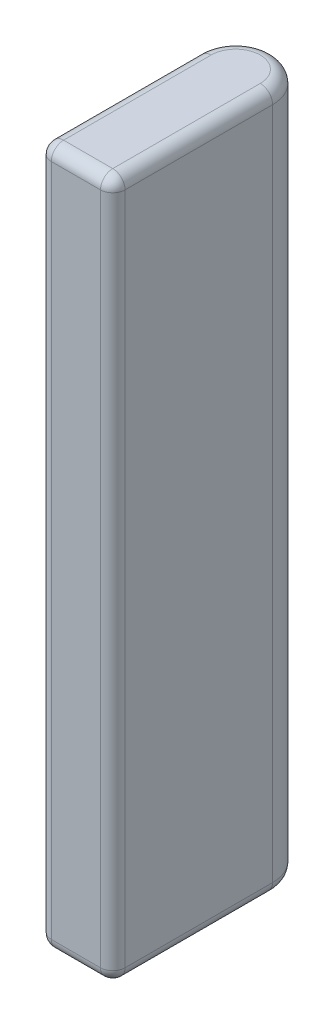
ISO-10303-21;
HEADER;
FILE_DESCRIPTION(('STEP AP214'),'2;1');
FILE_NAME('part.step','',(''),(''),'','','');
FILE_SCHEMA(('AUTOMOTIVE_DESIGN { 1 0 10303 214 1 1 1 1 }'));
ENDSEC;
DATA;
#1=APPLICATION_CONTEXT('core data for automotive mechanical design processes');
#2=APPLICATION_PROTOCOL_DEFINITION('international standard','automotive_design',2000,#1);
#3=PRODUCT_CONTEXT('',#1,'mechanical');
#4=PRODUCT('Part','Part','',(#3));
#5=PRODUCT_RELATED_PRODUCT_CATEGORY('part','',(#4));
#6=PRODUCT_DEFINITION_FORMATION('','',#4);
#7=PRODUCT_DEFINITION_CONTEXT('part definition',#1,'design');
#8=PRODUCT_DEFINITION('design','',#6,#7);
#9=PRODUCT_DEFINITION_SHAPE('','',#8);
#10=(LENGTH_UNIT() NAMED_UNIT(*) SI_UNIT(.MILLI.,.METRE.));
#11=(NAMED_UNIT(*) PLANE_ANGLE_UNIT() SI_UNIT($,.RADIAN.));
#12=(NAMED_UNIT(*) SI_UNIT($,.STERADIAN.) SOLID_ANGLE_UNIT());
#13=UNCERTAINTY_MEASURE_WITH_UNIT(LENGTH_MEASURE(1.E-05),#10,'distance_accuracy_value','');
#14=(GEOMETRIC_REPRESENTATION_CONTEXT(3) GLOBAL_UNCERTAINTY_ASSIGNED_CONTEXT((#13)) GLOBAL_UNIT_ASSIGNED_CONTEXT((#10,
#11,#12)) REPRESENTATION_CONTEXT('',''));
#15=CARTESIAN_POINT('',(0.,0.,0.));
#16=DIRECTION('',(0.,0.,1.));
#17=DIRECTION('',(1.,0.,0.));
#18=AXIS2_PLACEMENT_3D('',#15,#16,#17);
#19=CARTESIAN_POINT('',(0.,28.4,-3.25));
#20=DIRECTION('',(0.,-1.,0.));
#21=DIRECTION('',(0.,0.,-1.));
#22=AXIS2_PLACEMENT_3D('',#19,#20,#21);
#23=CYLINDRICAL_SURFACE('',#22,1.5);
#24=DIRECTION('',(0.,-1.,0.));
#25=VECTOR('',#24,1.);
#26=CARTESIAN_POINT('',(1.5,28.4,-3.25));
#27=LINE('',#26,#25);
#28=CARTESIAN_POINT('',(1.5,27.9,-3.25));
#29=VERTEX_POINT('',#28);
#30=CARTESIAN_POINT('',(1.5,0.5,-3.25));
#31=VERTEX_POINT('',#30);
#32=EDGE_CURVE('E159',#29,#31,#27,.T.);
#33=ORIENTED_EDGE('',*,*,#32,.T.);
#34=CARTESIAN_POINT('',(0.,0.5,-3.25));
#35=DIRECTION('',(0.,1.,0.));
#36=DIRECTION('',(0.,0.,1.));
#37=AXIS2_PLACEMENT_3D('',#34,#35,#36);
#38=CIRCLE('',#37,1.5);
#39=CARTESIAN_POINT('',(-1.5,0.5,-3.25));
#40=VERTEX_POINT('',#39);
#41=EDGE_CURVE('E188',#31,#40,#38,.T.);
#42=ORIENTED_EDGE('',*,*,#41,.T.);
#43=DIRECTION('',(0.,-1.,0.));
#44=VECTOR('',#43,1.);
#45=CARTESIAN_POINT('',(-1.5,28.4,-3.25));
#46=LINE('',#45,#44);
#47=CARTESIAN_POINT('',(-1.5,27.9,-3.25));
#48=VERTEX_POINT('',#47);
#49=EDGE_CURVE('E156',#48,#40,#46,.T.);
#50=ORIENTED_EDGE('',*,*,#49,.F.);
#51=CARTESIAN_POINT('',(0.,27.9,-3.25));
#52=DIRECTION('',(0.,1.,0.));
#53=DIRECTION('',(0.,0.,1.));
#54=AXIS2_PLACEMENT_3D('',#51,#52,#53);
#55=CIRCLE('',#54,1.5);
#56=EDGE_CURVE('E186',#48,#29,#55,.F.);
#57=ORIENTED_EDGE('',*,*,#56,.T.);
#58=EDGE_LOOP('',(#33,#42,#50,#57));
#59=FACE_BOUND('',#58,.T.);
#60=ADVANCED_FACE('F44',(#59),#23,.T.);
#61=CARTESIAN_POINT('',(-1.5,28.4,0.));
#62=DIRECTION('',(1.,0.,0.));
#63=DIRECTION('',(0.,0.,-1.));
#64=AXIS2_PLACEMENT_3D('',#61,#62,#63);
#65=PLANE('',#64);
#66=ORIENTED_EDGE('',*,*,#49,.T.);
#67=DIRECTION('',(0.,0.,1.));
#68=VECTOR('',#67,1.);
#69=CARTESIAN_POINT('',(-1.5,0.5,0.));
#70=LINE('',#69,#68);
#71=CARTESIAN_POINT('',(-1.5,0.5,2.75));
#72=VERTEX_POINT('',#71);
#73=EDGE_CURVE('E170',#40,#72,#70,.T.);
#74=ORIENTED_EDGE('',*,*,#73,.T.);
#75=DIRECTION('',(0.,-1.,0.));
#76=VECTOR('',#75,1.);
#77=CARTESIAN_POINT('',(-1.5,28.4,2.75));
#78=LINE('',#77,#76);
#79=CARTESIAN_POINT('',(-1.5,27.9,2.75));
#80=VERTEX_POINT('',#79);
#81=EDGE_CURVE('E167',#72,#80,#78,.F.);
#82=ORIENTED_EDGE('',*,*,#81,.T.);
#83=DIRECTION('',(0.,0.,1.));
#84=VECTOR('',#83,1.);
#85=CARTESIAN_POINT('',(-1.5,27.9,-3.25));
#86=LINE('',#85,#84);
#87=EDGE_CURVE('E165',#80,#48,#86,.F.);
#88=ORIENTED_EDGE('',*,*,#87,.T.);
#89=EDGE_LOOP('',(#66,#74,#82,#88));
#90=FACE_BOUND('',#89,.T.);
#91=ADVANCED_FACE('F248',(#90),#65,.F.);
#92=CARTESIAN_POINT('',(0.,28.4,3.25));
#93=DIRECTION('',(0.,0.,-1.));
#94=DIRECTION('',(-1.,0.,0.));
#95=AXIS2_PLACEMENT_3D('',#92,#93,#94);
#96=PLANE('',#95);
#97=DIRECTION('',(0.,-1.,0.));
#98=VECTOR('',#97,1.);
#99=CARTESIAN_POINT('',(-0.999999999999999,28.4,3.25));
#100=LINE('',#99,#98);
#101=CARTESIAN_POINT('',(-0.999999999999999,27.9,3.25));
#102=VERTEX_POINT('',#101);
#103=CARTESIAN_POINT('',(-0.999999999999999,0.5,3.25));
#104=VERTEX_POINT('',#103);
#105=EDGE_CURVE('E131',#102,#104,#100,.T.);
#106=ORIENTED_EDGE('',*,*,#105,.T.);
#107=DIRECTION('',(1.,0.,0.));
#108=VECTOR('',#107,1.);
#109=CARTESIAN_POINT('',(0.,0.5,3.25));
#110=LINE('',#109,#108);
#111=CARTESIAN_POINT('',(1.,0.5,3.25));
#112=VERTEX_POINT('',#111);
#113=EDGE_CURVE('E127',#104,#112,#110,.T.);
#114=ORIENTED_EDGE('',*,*,#113,.T.);
#115=DIRECTION('',(0.,-1.,0.));
#116=VECTOR('',#115,1.);
#117=CARTESIAN_POINT('',(1.,28.4,3.25));
#118=LINE('',#117,#116);
#119=CARTESIAN_POINT('',(1.,27.9,3.25));
#120=VERTEX_POINT('',#119);
#121=EDGE_CURVE('E119',#112,#120,#118,.F.);
#122=ORIENTED_EDGE('',*,*,#121,.T.);
#123=DIRECTION('',(1.,0.,0.));
#124=VECTOR('',#123,1.);
#125=CARTESIAN_POINT('',(-1.5,27.9,3.25));
#126=LINE('',#125,#124);
#127=EDGE_CURVE('E124',#120,#102,#126,.F.);
#128=ORIENTED_EDGE('',*,*,#127,.T.);
#129=EDGE_LOOP('',(#106,#114,#122,#128));
#130=FACE_BOUND('',#129,.T.);
#131=ADVANCED_FACE('F122',(#130),#96,.F.);
#132=CARTESIAN_POINT('',(1.5,28.4,0.));
#133=DIRECTION('',(1.,0.,0.));
#134=DIRECTION('',(0.,0.,-1.));
#135=AXIS2_PLACEMENT_3D('',#132,#133,#134);
#136=PLANE('',#135);
#137=DIRECTION('',(0.,-1.,0.));
#138=VECTOR('',#137,1.);
#139=CARTESIAN_POINT('',(1.5,0.,2.75));
#140=LINE('',#139,#138);
#141=CARTESIAN_POINT('',(1.5,27.9,2.75));
#142=VERTEX_POINT('',#141);
#143=CARTESIAN_POINT('',(1.5,0.5,2.75));
#144=VERTEX_POINT('',#143);
#145=EDGE_CURVE('E138',#142,#144,#140,.T.);
#146=ORIENTED_EDGE('',*,*,#145,.T.);
#147=DIRECTION('',(0.,0.,1.));
#148=VECTOR('',#147,1.);
#149=CARTESIAN_POINT('',(1.5,0.5,-3.25));
#150=LINE('',#149,#148);
#151=EDGE_CURVE('E175',#144,#31,#150,.F.);
#152=ORIENTED_EDGE('',*,*,#151,.T.);
#153=ORIENTED_EDGE('',*,*,#32,.F.);
#154=DIRECTION('',(0.,0.,1.));
#155=VECTOR('',#154,1.);
#156=CARTESIAN_POINT('',(1.5,27.9,0.));
#157=LINE('',#156,#155);
#158=EDGE_CURVE('E172',#29,#142,#157,.T.);
#159=ORIENTED_EDGE('',*,*,#158,.T.);
#160=EDGE_LOOP('',(#146,#152,#153,#159));
#161=FACE_BOUND('',#160,.T.);
#162=ADVANCED_FACE('F400',(#161),#136,.T.);
#163=CARTESIAN_POINT('',(0.,28.4,0.));
#164=DIRECTION('',(0.,1.,0.));
#165=DIRECTION('',(0.,0.,1.));
#166=AXIS2_PLACEMENT_3D('',#163,#164,#165);
#167=PLANE('',#166);
#168=DIRECTION('',(1.,0.,0.));
#169=VECTOR('',#168,1.);
#170=CARTESIAN_POINT('',(1.5,28.4,2.75));
#171=LINE('',#170,#169);
#172=CARTESIAN_POINT('',(-0.999999999999999,28.4,2.75));
#173=VERTEX_POINT('',#172);
#174=CARTESIAN_POINT('',(1.,28.4,2.75));
#175=VERTEX_POINT('',#174);
#176=EDGE_CURVE('E53',#173,#175,#171,.T.);
#177=ORIENTED_EDGE('',*,*,#176,.T.);
#178=DIRECTION('',(0.,0.,1.));
#179=VECTOR('',#178,1.);
#180=CARTESIAN_POINT('',(1.,28.4,0.));
#181=LINE('',#180,#179);
#182=CARTESIAN_POINT('',(1.,28.4,-3.25));
#183=VERTEX_POINT('',#182);
#184=EDGE_CURVE('E11',#175,#183,#181,.F.);
#185=ORIENTED_EDGE('',*,*,#184,.T.);
#186=CARTESIAN_POINT('',(0.,28.4,-3.25));
#187=DIRECTION('',(0.,1.,0.));
#188=DIRECTION('',(0.,0.,1.));
#189=AXIS2_PLACEMENT_3D('',#186,#187,#188);
#190=CIRCLE('',#189,1.);
#191=CARTESIAN_POINT('',(-1.,28.4,-3.25));
#192=VERTEX_POINT('',#191);
#193=EDGE_CURVE('E190',#183,#192,#190,.T.);
#194=ORIENTED_EDGE('',*,*,#193,.T.);
#195=DIRECTION('',(0.,0.,1.));
#196=VECTOR('',#195,1.);
#197=CARTESIAN_POINT('',(-0.999999999999999,28.4,3.25));
#198=LINE('',#197,#196);
#199=EDGE_CURVE('E64',#192,#173,#198,.T.);
#200=ORIENTED_EDGE('',*,*,#199,.T.);
#201=EDGE_LOOP('',(#177,#185,#194,#200));
#202=FACE_BOUND('',#201,.T.);
#203=ADVANCED_FACE('F390',(#202),#167,.T.);
#204=CARTESIAN_POINT('',(0.,0.,0.));
#205=DIRECTION('',(0.,1.,0.));
#206=DIRECTION('',(0.,0.,1.));
#207=AXIS2_PLACEMENT_3D('',#204,#205,#206);
#208=PLANE('',#207);
#209=DIRECTION('',(1.,0.,0.));
#210=VECTOR('',#209,1.);
#211=CARTESIAN_POINT('',(0.,0.,2.75));
#212=LINE('',#211,#210);
#213=CARTESIAN_POINT('',(1.,0.,2.75));
#214=VERTEX_POINT('',#213);
#215=CARTESIAN_POINT('',(-0.999999999999999,0.,2.75));
#216=VERTEX_POINT('',#215);
#217=EDGE_CURVE('E181',#214,#216,#212,.F.);
#218=ORIENTED_EDGE('',*,*,#217,.T.);
#219=DIRECTION('',(0.,0.,1.));
#220=VECTOR('',#219,1.);
#221=CARTESIAN_POINT('',(-1.,0.,0.));
#222=LINE('',#221,#220);
#223=CARTESIAN_POINT('',(-1.,0.,-3.25));
#224=VERTEX_POINT('',#223);
#225=EDGE_CURVE('E183',#216,#224,#222,.F.);
#226=ORIENTED_EDGE('',*,*,#225,.T.);
#227=CARTESIAN_POINT('',(0.,0.,-3.25));
#228=DIRECTION('',(0.,1.,0.));
#229=DIRECTION('',(0.,0.,1.));
#230=AXIS2_PLACEMENT_3D('',#227,#228,#229);
#231=CIRCLE('',#230,1.);
#232=CARTESIAN_POINT('',(1.,0.,-3.25));
#233=VERTEX_POINT('',#232);
#234=EDGE_CURVE('E177',#224,#233,#231,.F.);
#235=ORIENTED_EDGE('',*,*,#234,.T.);
#236=DIRECTION('',(0.,0.,1.));
#237=VECTOR('',#236,1.);
#238=CARTESIAN_POINT('',(1.,0.,3.25));
#239=LINE('',#238,#237);
#240=EDGE_CURVE('E179',#233,#214,#239,.T.);
#241=ORIENTED_EDGE('',*,*,#240,.T.);
#242=EDGE_LOOP('',(#218,#226,#235,#241));
#243=FACE_BOUND('',#242,.T.);
#244=ADVANCED_FACE('F381',(#243),#208,.F.);
#245=CARTESIAN_POINT('',(1.,27.9,0.));
#246=DIRECTION('',(0.,0.,1.));
#247=DIRECTION('',(1.,0.,0.));
#248=AXIS2_PLACEMENT_3D('',#245,#246,#247);
#249=CYLINDRICAL_SURFACE('',#248,0.5);
#250=CARTESIAN_POINT('',(1.,27.9,2.75));
#251=DIRECTION('',(0.,0.,1.));
#252=DIRECTION('',(1.,0.,0.));
#253=AXIS2_PLACEMENT_3D('',#250,#251,#252);
#254=CIRCLE('',#253,0.5);
#255=EDGE_CURVE('E142',#142,#175,#254,.T.);
#256=ORIENTED_EDGE('',*,*,#255,.F.);
#257=ORIENTED_EDGE('',*,*,#158,.F.);
#258=CARTESIAN_POINT('',(1.,27.9,-3.25));
#259=DIRECTION('',(0.,0.,-1.));
#260=DIRECTION('',(-1.,0.,0.));
#261=AXIS2_PLACEMENT_3D('',#258,#259,#260);
#262=CIRCLE('',#261,0.5);
#263=EDGE_CURVE('E48',#183,#29,#262,.T.);
#264=ORIENTED_EDGE('',*,*,#263,.F.);
#265=ORIENTED_EDGE('',*,*,#184,.F.);
#266=EDGE_LOOP('',(#256,#257,#264,#265));
#267=FACE_BOUND('',#266,.T.);
#268=ADVANCED_FACE('F46',(#267),#249,.T.);
#269=CARTESIAN_POINT('',(1.,28.4,2.75));
#270=DIRECTION('',(0.,1.,0.));
#271=DIRECTION('',(0.,0.,1.));
#272=AXIS2_PLACEMENT_3D('',#269,#270,#271);
#273=CYLINDRICAL_SURFACE('',#272,0.5);
#274=CARTESIAN_POINT('',(1.,0.5,2.75));
#275=DIRECTION('',(0.,-1.,0.));
#276=DIRECTION('',(0.,0.,-1.));
#277=AXIS2_PLACEMENT_3D('',#274,#275,#276);
#278=CIRCLE('',#277,0.5);
#279=EDGE_CURVE('E143',#144,#112,#278,.T.);
#280=ORIENTED_EDGE('',*,*,#279,.F.);
#281=ORIENTED_EDGE('',*,*,#145,.F.);
#282=CARTESIAN_POINT('',(1.,27.9,2.75));
#283=DIRECTION('',(0.,1.,0.));
#284=DIRECTION('',(0.,0.,1.));
#285=AXIS2_PLACEMENT_3D('',#282,#283,#284);
#286=CIRCLE('',#285,0.5);
#287=EDGE_CURVE('E135',#120,#142,#286,.T.);
#288=ORIENTED_EDGE('',*,*,#287,.F.);
#289=ORIENTED_EDGE('',*,*,#121,.F.);
#290=EDGE_LOOP('',(#280,#281,#288,#289));
#291=FACE_BOUND('',#290,.T.);
#292=ADVANCED_FACE('F137',(#291),#273,.T.);
#293=CARTESIAN_POINT('',(1.,0.5,0.));
#294=DIRECTION('',(0.,0.,-1.));
#295=DIRECTION('',(-1.,0.,0.));
#296=AXIS2_PLACEMENT_3D('',#293,#294,#295);
#297=CYLINDRICAL_SURFACE('',#296,0.5);
#298=CARTESIAN_POINT('',(1.,0.5,-3.25));
#299=DIRECTION('',(0.,0.,-1.));
#300=DIRECTION('',(-1.,0.,0.));
#301=AXIS2_PLACEMENT_3D('',#298,#299,#300);
#302=CIRCLE('',#301,0.5);
#303=EDGE_CURVE('E214',#31,#233,#302,.T.);
#304=ORIENTED_EDGE('',*,*,#303,.F.);
#305=ORIENTED_EDGE('',*,*,#151,.F.);
#306=CARTESIAN_POINT('',(1.,0.5,2.75));
#307=DIRECTION('',(0.,0.,1.));
#308=DIRECTION('',(1.,0.,0.));
#309=AXIS2_PLACEMENT_3D('',#306,#307,#308);
#310=CIRCLE('',#309,0.5);
#311=EDGE_CURVE('E217',#214,#144,#310,.T.);
#312=ORIENTED_EDGE('',*,*,#311,.F.);
#313=ORIENTED_EDGE('',*,*,#240,.F.);
#314=EDGE_LOOP('',(#304,#305,#312,#313));
#315=FACE_BOUND('',#314,.T.);
#316=ADVANCED_FACE('F235',(#315),#297,.T.);
#317=CARTESIAN_POINT('',(0.,27.9,-3.25));
#318=DIRECTION('',(0.,1.,0.));
#319=DIRECTION('',(0.,0.,1.));
#320=AXIS2_PLACEMENT_3D('',#317,#318,#319);
#321=TOROIDAL_SURFACE('',#320,1.,0.5);
#322=ORIENTED_EDGE('',*,*,#263,.T.);
#323=ORIENTED_EDGE('',*,*,#56,.F.);
#324=CARTESIAN_POINT('',(-1.,27.9,-3.25));
#325=DIRECTION('',(0.,0.,1.));
#326=DIRECTION('',(1.,0.,0.));
#327=AXIS2_PLACEMENT_3D('',#324,#325,#326);
#328=CIRCLE('',#327,0.5);
#329=EDGE_CURVE('E149',#192,#48,#328,.T.);
#330=ORIENTED_EDGE('',*,*,#329,.F.);
#331=ORIENTED_EDGE('',*,*,#193,.F.);
#332=EDGE_LOOP('',(#322,#323,#330,#331));
#333=FACE_BOUND('',#332,.T.);
#334=ADVANCED_FACE('F251',(#333),#321,.T.);
#335=CARTESIAN_POINT('',(1.,27.9,2.75));
#336=DIRECTION('',(1.,0.,0.));
#337=DIRECTION('',(0.,0.,-1.));
#338=AXIS2_PLACEMENT_3D('',#335,#336,#337);
#339=SPHERICAL_SURFACE('',#338,0.5);
#340=ORIENTED_EDGE('',*,*,#287,.T.);
#341=ORIENTED_EDGE('',*,*,#255,.T.);
#342=CARTESIAN_POINT('',(1.,27.9,2.75));
#343=DIRECTION('',(1.,0.,0.));
#344=DIRECTION('',(0.,0.,-1.));
#345=AXIS2_PLACEMENT_3D('',#342,#343,#344);
#346=CIRCLE('',#345,0.5);
#347=EDGE_CURVE('E146',#120,#175,#346,.F.);
#348=ORIENTED_EDGE('',*,*,#347,.F.);
#349=EDGE_LOOP('',(#340,#341,#348));
#350=FACE_BOUND('',#349,.T.);
#351=ADVANCED_FACE('F147',(#350),#339,.T.);
#352=CARTESIAN_POINT('',(1.,0.5,2.75));
#353=DIRECTION('',(1.,0.,0.));
#354=DIRECTION('',(0.,0.,-1.));
#355=AXIS2_PLACEMENT_3D('',#352,#353,#354);
#356=SPHERICAL_SURFACE('',#355,0.5);
#357=ORIENTED_EDGE('',*,*,#311,.T.);
#358=ORIENTED_EDGE('',*,*,#279,.T.);
#359=CARTESIAN_POINT('',(1.,0.5,2.75));
#360=DIRECTION('',(1.,0.,0.));
#361=DIRECTION('',(0.,0.,-1.));
#362=AXIS2_PLACEMENT_3D('',#359,#360,#361);
#363=CIRCLE('',#362,0.5);
#364=EDGE_CURVE('E150',#214,#112,#363,.F.);
#365=ORIENTED_EDGE('',*,*,#364,.F.);
#366=EDGE_LOOP('',(#357,#358,#365));
#367=FACE_BOUND('',#366,.T.);
#368=ADVANCED_FACE('F269',(#367),#356,.T.);
#369=CARTESIAN_POINT('',(0.,0.5,-3.25));
#370=DIRECTION('',(0.,1.,0.));
#371=DIRECTION('',(0.,0.,1.));
#372=AXIS2_PLACEMENT_3D('',#369,#370,#371);
#373=TOROIDAL_SURFACE('',#372,1.,0.5);
#374=ORIENTED_EDGE('',*,*,#303,.T.);
#375=ORIENTED_EDGE('',*,*,#234,.F.);
#376=CARTESIAN_POINT('',(-1.,0.5,-3.25));
#377=DIRECTION('',(0.,0.,1.));
#378=DIRECTION('',(1.,0.,0.));
#379=AXIS2_PLACEMENT_3D('',#376,#377,#378);
#380=CIRCLE('',#379,0.5);
#381=EDGE_CURVE('E208',#40,#224,#380,.T.);
#382=ORIENTED_EDGE('',*,*,#381,.F.);
#383=ORIENTED_EDGE('',*,*,#41,.F.);
#384=EDGE_LOOP('',(#374,#375,#382,#383));
#385=FACE_BOUND('',#384,.T.);
#386=ADVANCED_FACE('F240',(#385),#373,.T.);
#387=CARTESIAN_POINT('',(-1.,27.9,0.));
#388=DIRECTION('',(0.,0.,-1.));
#389=DIRECTION('',(-1.,0.,0.));
#390=AXIS2_PLACEMENT_3D('',#387,#388,#389);
#391=CYLINDRICAL_SURFACE('',#390,0.5);
#392=ORIENTED_EDGE('',*,*,#329,.T.);
#393=ORIENTED_EDGE('',*,*,#87,.F.);
#394=CARTESIAN_POINT('',(-0.999999999999999,27.9,2.75));
#395=DIRECTION('',(0.,0.,1.));
#396=DIRECTION('',(1.,0.,0.));
#397=AXIS2_PLACEMENT_3D('',#394,#395,#396);
#398=CIRCLE('',#397,0.5);
#399=EDGE_CURVE('E205',#173,#80,#398,.T.);
#400=ORIENTED_EDGE('',*,*,#399,.F.);
#401=ORIENTED_EDGE('',*,*,#199,.F.);
#402=EDGE_LOOP('',(#392,#393,#400,#401));
#403=FACE_BOUND('',#402,.T.);
#404=ADVANCED_FACE('F253',(#403),#391,.T.);
#405=CARTESIAN_POINT('',(0.,27.9,2.75));
#406=DIRECTION('',(-1.,0.,0.));
#407=DIRECTION('',(0.,0.,1.));
#408=AXIS2_PLACEMENT_3D('',#405,#406,#407);
#409=CYLINDRICAL_SURFACE('',#408,0.5);
#410=ORIENTED_EDGE('',*,*,#347,.T.);
#411=ORIENTED_EDGE('',*,*,#176,.F.);
#412=CARTESIAN_POINT('',(-0.999999999999999,27.9,2.75));
#413=DIRECTION('',(-1.,0.,0.));
#414=DIRECTION('',(0.,0.,1.));
#415=AXIS2_PLACEMENT_3D('',#412,#413,#414);
#416=CIRCLE('',#415,0.5);
#417=EDGE_CURVE('E154',#102,#173,#416,.T.);
#418=ORIENTED_EDGE('',*,*,#417,.F.);
#419=ORIENTED_EDGE('',*,*,#127,.F.);
#420=EDGE_LOOP('',(#410,#411,#418,#419));
#421=FACE_BOUND('',#420,.T.);
#422=ADVANCED_FACE('F152',(#421),#409,.T.);
#423=CARTESIAN_POINT('',(0.,0.5,2.75));
#424=DIRECTION('',(1.,0.,0.));
#425=DIRECTION('',(0.,0.,-1.));
#426=AXIS2_PLACEMENT_3D('',#423,#424,#425);
#427=CYLINDRICAL_SURFACE('',#426,0.5);
#428=ORIENTED_EDGE('',*,*,#364,.T.);
#429=ORIENTED_EDGE('',*,*,#113,.F.);
#430=CARTESIAN_POINT('',(-0.999999999999999,0.5,2.75));
#431=DIRECTION('',(-1.,0.,0.));
#432=DIRECTION('',(0.,0.,1.));
#433=AXIS2_PLACEMENT_3D('',#430,#431,#432);
#434=CIRCLE('',#433,0.5);
#435=EDGE_CURVE('E201',#216,#104,#434,.T.);
#436=ORIENTED_EDGE('',*,*,#435,.F.);
#437=ORIENTED_EDGE('',*,*,#217,.F.);
#438=EDGE_LOOP('',(#428,#429,#436,#437));
#439=FACE_BOUND('',#438,.T.);
#440=ADVANCED_FACE('F266',(#439),#427,.T.);
#441=CARTESIAN_POINT('',(-1.,0.5,0.));
#442=DIRECTION('',(0.,0.,1.));
#443=DIRECTION('',(1.,0.,0.));
#444=AXIS2_PLACEMENT_3D('',#441,#442,#443);
#445=CYLINDRICAL_SURFACE('',#444,0.5);
#446=ORIENTED_EDGE('',*,*,#381,.T.);
#447=ORIENTED_EDGE('',*,*,#225,.F.);
#448=CARTESIAN_POINT('',(-0.999999999999999,0.5,2.75));
#449=DIRECTION('',(0.,0.,1.));
#450=DIRECTION('',(1.,0.,0.));
#451=AXIS2_PLACEMENT_3D('',#448,#449,#450);
#452=CIRCLE('',#451,0.5);
#453=EDGE_CURVE('E198',#72,#216,#452,.T.);
#454=ORIENTED_EDGE('',*,*,#453,.F.);
#455=ORIENTED_EDGE('',*,*,#73,.F.);
#456=EDGE_LOOP('',(#446,#447,#454,#455));
#457=FACE_BOUND('',#456,.T.);
#458=ADVANCED_FACE('F245',(#457),#445,.T.);
#459=CARTESIAN_POINT('',(-0.999999999999999,27.9,2.75));
#460=DIRECTION('',(0.,1.,0.));
#461=DIRECTION('',(0.,0.,1.));
#462=AXIS2_PLACEMENT_3D('',#459,#460,#461);
#463=SPHERICAL_SURFACE('',#462,0.5);
#464=ORIENTED_EDGE('',*,*,#417,.T.);
#465=ORIENTED_EDGE('',*,*,#399,.T.);
#466=CARTESIAN_POINT('',(-0.999999999999999,27.9,2.75));
#467=DIRECTION('',(0.,1.,0.));
#468=DIRECTION('',(0.,0.,1.));
#469=AXIS2_PLACEMENT_3D('',#466,#467,#468);
#470=CIRCLE('',#469,0.5);
#471=EDGE_CURVE('E196',#102,#80,#470,.F.);
#472=ORIENTED_EDGE('',*,*,#471,.F.);
#473=EDGE_LOOP('',(#464,#465,#472));
#474=FACE_BOUND('',#473,.T.);
#475=ADVANCED_FACE('F256',(#474),#463,.T.);
#476=CARTESIAN_POINT('',(-0.999999999999999,0.5,2.75));
#477=DIRECTION('',(0.,-1.,0.));
#478=DIRECTION('',(0.,0.,-1.));
#479=AXIS2_PLACEMENT_3D('',#476,#477,#478);
#480=SPHERICAL_SURFACE('',#479,0.5);
#481=ORIENTED_EDGE('',*,*,#453,.T.);
#482=ORIENTED_EDGE('',*,*,#435,.T.);
#483=CARTESIAN_POINT('',(-0.999999999999999,0.5,2.75));
#484=DIRECTION('',(0.,-1.,0.));
#485=DIRECTION('',(0.,0.,-1.));
#486=AXIS2_PLACEMENT_3D('',#483,#484,#485);
#487=CIRCLE('',#486,0.5);
#488=EDGE_CURVE('E194',#72,#104,#487,.F.);
#489=ORIENTED_EDGE('',*,*,#488,.F.);
#490=EDGE_LOOP('',(#481,#482,#489));
#491=FACE_BOUND('',#490,.T.);
#492=ADVANCED_FACE('F263',(#491),#480,.T.);
#493=CARTESIAN_POINT('',(-0.999999999999999,28.4,2.75));
#494=DIRECTION('',(0.,-1.,0.));
#495=DIRECTION('',(0.,0.,-1.));
#496=AXIS2_PLACEMENT_3D('',#493,#494,#495);
#497=CYLINDRICAL_SURFACE('',#496,0.5);
#498=ORIENTED_EDGE('',*,*,#471,.T.);
#499=ORIENTED_EDGE('',*,*,#81,.F.);
#500=ORIENTED_EDGE('',*,*,#488,.T.);
#501=ORIENTED_EDGE('',*,*,#105,.F.);
#502=EDGE_LOOP('',(#498,#499,#500,#501));
#503=FACE_BOUND('',#502,.T.);
#504=ADVANCED_FACE('F259',(#503),#497,.T.);
#505=CLOSED_SHELL('',(#60,#91,#131,#162,#203,#244,#268,#292,#316,#334,#351,#368,#386,#404,#422,
#440,#458,#475,#492,#504));
#506=MANIFOLD_SOLID_BREP('B2',#505);
#507=ADVANCED_BREP_SHAPE_REPRESENTATION('',(#18,#506),#14);
#508=SHAPE_DEFINITION_REPRESENTATION(#9,#507);
ENDSEC;
END-ISO-10303-21;
